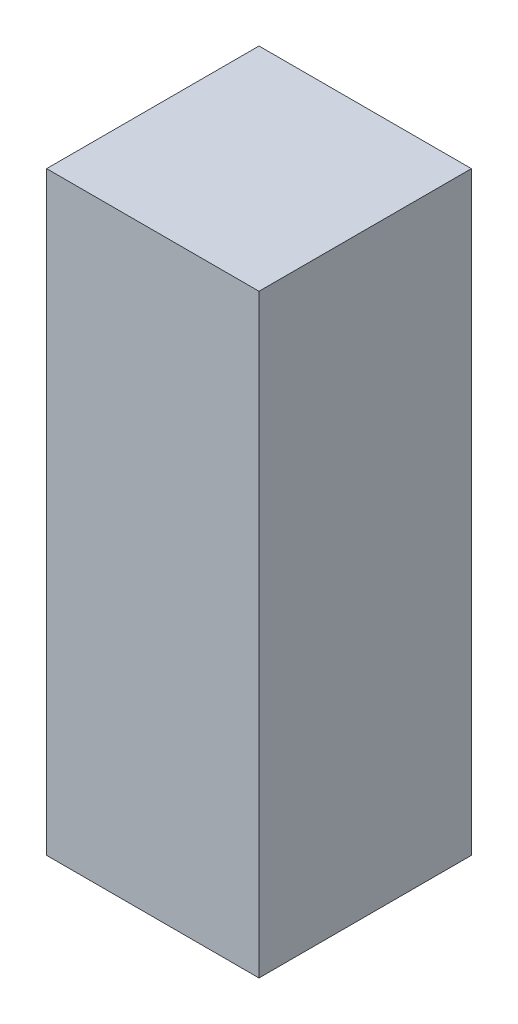
ISO-10303-21;
HEADER;
FILE_DESCRIPTION(('STEP AP214'),'2;1');
FILE_NAME('part.step','',(''),(''),'','','');
FILE_SCHEMA(('AUTOMOTIVE_DESIGN { 1 0 10303 214 1 1 1 1 }'));
ENDSEC;
DATA;
#1=APPLICATION_CONTEXT('core data for automotive mechanical design processes');
#2=APPLICATION_PROTOCOL_DEFINITION('international standard','automotive_design',2000,#1);
#3=PRODUCT_CONTEXT('',#1,'mechanical');
#4=PRODUCT('Part','Part','',(#3));
#5=PRODUCT_RELATED_PRODUCT_CATEGORY('part','',(#4));
#6=PRODUCT_DEFINITION_FORMATION('','',#4);
#7=PRODUCT_DEFINITION_CONTEXT('part definition',#1,'design');
#8=PRODUCT_DEFINITION('design','',#6,#7);
#9=PRODUCT_DEFINITION_SHAPE('','',#8);
#10=(LENGTH_UNIT() NAMED_UNIT(*) SI_UNIT(.MILLI.,.METRE.));
#11=(NAMED_UNIT(*) PLANE_ANGLE_UNIT() SI_UNIT($,.RADIAN.));
#12=(NAMED_UNIT(*) SI_UNIT($,.STERADIAN.) SOLID_ANGLE_UNIT());
#13=UNCERTAINTY_MEASURE_WITH_UNIT(LENGTH_MEASURE(1.E-05),#10,'distance_accuracy_value','');
#14=(GEOMETRIC_REPRESENTATION_CONTEXT(3) GLOBAL_UNCERTAINTY_ASSIGNED_CONTEXT((#13)) GLOBAL_UNIT_ASSIGNED_CONTEXT((#10,
#11,#12)) REPRESENTATION_CONTEXT('',''));
#15=CARTESIAN_POINT('',(0.,0.,0.));
#16=DIRECTION('',(0.,0.,1.));
#17=DIRECTION('',(1.,0.,0.));
#18=AXIS2_PLACEMENT_3D('',#15,#16,#17);
#19=CARTESIAN_POINT('',(2.19999995082617,-10.0099997764826,0.99));
#20=DIRECTION('',(1.,0.,0.));
#21=DIRECTION('',(0.,1.,0.));
#22=AXIS2_PLACEMENT_3D('',#19,#20,#21);
#23=PLANE('',#22);
#24=DIRECTION('',(0.,1.,0.));
#25=VECTOR('',#24,1.);
#26=CARTESIAN_POINT('',(2.19999995082617,-9.29999979212881,1.5));
#27=LINE('',#26,#25);
#28=CARTESIAN_POINT('',(2.19999995082617,-9.99999977648258,1.5));
#29=VERTEX_POINT('',#28);
#30=CARTESIAN_POINT('',(2.19999995082617,-8.59999980777502,1.5));
#31=VERTEX_POINT('',#30);
#32=EDGE_CURVE('E68',#29,#31,#27,.T.);
#33=ORIENTED_EDGE('',*,*,#32,.F.);
#34=DIRECTION('',(0.,0.,-1.));
#35=VECTOR('',#34,1.);
#36=CARTESIAN_POINT('',(2.19999995082617,-9.99999977648258,1.25));
#37=LINE('',#36,#35);
#38=CARTESIAN_POINT('',(2.19999995082617,-9.99999977648258,1.));
#39=VERTEX_POINT('',#38);
#40=EDGE_CURVE('E54',#29,#39,#37,.T.);
#41=ORIENTED_EDGE('',*,*,#40,.T.);
#42=DIRECTION('',(0.,-1.,0.));
#43=VECTOR('',#42,1.);
#44=CARTESIAN_POINT('',(2.19999995082617,-9.29999979212881,1.));
#45=LINE('',#44,#43);
#46=CARTESIAN_POINT('',(2.19999995082617,-8.59999980777502,1.));
#47=VERTEX_POINT('',#46);
#48=EDGE_CURVE('E62',#47,#39,#45,.T.);
#49=ORIENTED_EDGE('',*,*,#48,.F.);
#50=DIRECTION('',(0.,0.,1.));
#51=VECTOR('',#50,1.);
#52=CARTESIAN_POINT('',(2.19999995082617,-8.59999980777502,1.25));
#53=LINE('',#52,#51);
#54=EDGE_CURVE('E20',#47,#31,#53,.T.);
#55=ORIENTED_EDGE('',*,*,#54,.T.);
#56=EDGE_LOOP('',(#33,#41,#49,#55));
#57=FACE_BOUND('',#56,.T.);
#58=ADVANCED_FACE('F16',(#57),#23,.T.);
#59=CARTESIAN_POINT('',(2.20999995082617,-10.0099997764826,1.));
#60=DIRECTION('',(0.,0.,-1.));
#61=DIRECTION('',(-1.,0.,0.));
#62=AXIS2_PLACEMENT_3D('',#59,#60,#61);
#63=PLANE('',#62);
#64=DIRECTION('',(-1.,0.,0.));
#65=VECTOR('',#64,1.);
#66=CARTESIAN_POINT('',(1.94999995641411,-8.59999980777502,1.));
#67=LINE('',#66,#65);
#68=CARTESIAN_POINT('',(1.69999996200204,-8.59999980777502,1.));
#69=VERTEX_POINT('',#68);
#70=EDGE_CURVE('E72',#47,#69,#67,.T.);
#71=ORIENTED_EDGE('',*,*,#70,.F.);
#72=ORIENTED_EDGE('',*,*,#48,.T.);
#73=DIRECTION('',(-1.,0.,0.));
#74=VECTOR('',#73,1.);
#75=CARTESIAN_POINT('',(1.94999995641411,-9.99999977648258,1.));
#76=LINE('',#75,#74);
#77=CARTESIAN_POINT('',(1.69999996200204,-9.99999977648258,1.));
#78=VERTEX_POINT('',#77);
#79=EDGE_CURVE('E56',#39,#78,#76,.T.);
#80=ORIENTED_EDGE('',*,*,#79,.T.);
#81=DIRECTION('',(0.,-1.,0.));
#82=VECTOR('',#81,1.);
#83=CARTESIAN_POINT('',(1.69999996200204,-9.29999979212881,1.));
#84=LINE('',#83,#82);
#85=EDGE_CURVE('E88',#69,#78,#84,.T.);
#86=ORIENTED_EDGE('',*,*,#85,.F.);
#87=EDGE_LOOP('',(#71,#72,#80,#86));
#88=FACE_BOUND('',#87,.T.);
#89=ADVANCED_FACE('F70',(#88),#63,.T.);
#90=CARTESIAN_POINT('',(1.68999996200204,-10.0099997764826,1.5));
#91=DIRECTION('',(0.,0.,1.));
#92=DIRECTION('',(1.,0.,0.));
#93=AXIS2_PLACEMENT_3D('',#90,#91,#92);
#94=PLANE('',#93);
#95=ORIENTED_EDGE('',*,*,#32,.T.);
#96=DIRECTION('',(1.,0.,0.));
#97=VECTOR('',#96,1.);
#98=CARTESIAN_POINT('',(1.94999995641411,-8.59999980777502,1.5));
#99=LINE('',#98,#97);
#100=CARTESIAN_POINT('',(1.69999996200204,-8.59999980777502,1.5));
#101=VERTEX_POINT('',#100);
#102=EDGE_CURVE('E84',#101,#31,#99,.T.);
#103=ORIENTED_EDGE('',*,*,#102,.F.);
#104=DIRECTION('',(0.,1.,0.));
#105=VECTOR('',#104,1.);
#106=CARTESIAN_POINT('',(1.69999996200204,-9.29999979212881,1.5));
#107=LINE('',#106,#105);
#108=CARTESIAN_POINT('',(1.69999996200204,-9.99999977648258,1.5));
#109=VERTEX_POINT('',#108);
#110=EDGE_CURVE('E91',#109,#101,#107,.T.);
#111=ORIENTED_EDGE('',*,*,#110,.F.);
#112=DIRECTION('',(1.,0.,0.));
#113=VECTOR('',#112,1.);
#114=CARTESIAN_POINT('',(1.94999995641411,-9.99999977648258,1.5));
#115=LINE('',#114,#113);
#116=EDGE_CURVE('E35',#109,#29,#115,.T.);
#117=ORIENTED_EDGE('',*,*,#116,.T.);
#118=EDGE_LOOP('',(#95,#103,#111,#117));
#119=FACE_BOUND('',#118,.T.);
#120=ADVANCED_FACE('F105',(#119),#94,.T.);
#121=CARTESIAN_POINT('',(2.20999995082617,-8.59999980777502,0.99));
#122=DIRECTION('',(0.,1.,0.));
#123=DIRECTION('',(-1.,0.,0.));
#124=AXIS2_PLACEMENT_3D('',#121,#122,#123);
#125=PLANE('',#124);
#126=ORIENTED_EDGE('',*,*,#102,.T.);
#127=ORIENTED_EDGE('',*,*,#54,.F.);
#128=ORIENTED_EDGE('',*,*,#70,.T.);
#129=DIRECTION('',(0.,0.,-1.));
#130=VECTOR('',#129,1.);
#131=CARTESIAN_POINT('',(1.69999996200204,-8.59999980777502,1.25));
#132=LINE('',#131,#130);
#133=EDGE_CURVE('E27',#101,#69,#132,.T.);
#134=ORIENTED_EDGE('',*,*,#133,.F.);
#135=EDGE_LOOP('',(#126,#127,#128,#134));
#136=FACE_BOUND('',#135,.T.);
#137=ADVANCED_FACE('F100',(#136),#125,.T.);
#138=CARTESIAN_POINT('',(1.69999996200204,-8.58999980777502,0.99));
#139=DIRECTION('',(-1.,0.,0.));
#140=DIRECTION('',(0.,-1.,0.));
#141=AXIS2_PLACEMENT_3D('',#138,#139,#140);
#142=PLANE('',#141);
#143=ORIENTED_EDGE('',*,*,#110,.T.);
#144=ORIENTED_EDGE('',*,*,#133,.T.);
#145=ORIENTED_EDGE('',*,*,#85,.T.);
#146=DIRECTION('',(0.,0.,-1.));
#147=VECTOR('',#146,1.);
#148=CARTESIAN_POINT('',(1.69999996200204,-9.99999977648258,1.25));
#149=LINE('',#148,#147);
#150=EDGE_CURVE('E11',#109,#78,#149,.T.);
#151=ORIENTED_EDGE('',*,*,#150,.F.);
#152=EDGE_LOOP('',(#143,#144,#145,#151));
#153=FACE_BOUND('',#152,.T.);
#154=ADVANCED_FACE('F98',(#153),#142,.T.);
#155=CARTESIAN_POINT('',(1.68999996200204,-9.99999977648258,1.51));
#156=DIRECTION('',(0.,-1.,0.));
#157=DIRECTION('',(0.,0.,-1.));
#158=AXIS2_PLACEMENT_3D('',#155,#156,#157);
#159=PLANE('',#158);
#160=ORIENTED_EDGE('',*,*,#116,.F.);
#161=ORIENTED_EDGE('',*,*,#150,.T.);
#162=ORIENTED_EDGE('',*,*,#79,.F.);
#163=ORIENTED_EDGE('',*,*,#40,.F.);
#164=EDGE_LOOP('',(#160,#161,#162,#163));
#165=FACE_BOUND('',#164,.T.);
#166=ADVANCED_FACE('F18',(#165),#159,.T.);
#167=CLOSED_SHELL('',(#58,#89,#120,#137,#154,#166));
#168=MANIFOLD_SOLID_BREP('B1',#167);
#169=ADVANCED_BREP_SHAPE_REPRESENTATION('',(#18,#168),#14);
#170=SHAPE_DEFINITION_REPRESENTATION(#9,#169);
ENDSEC;
END-ISO-10303-21;
